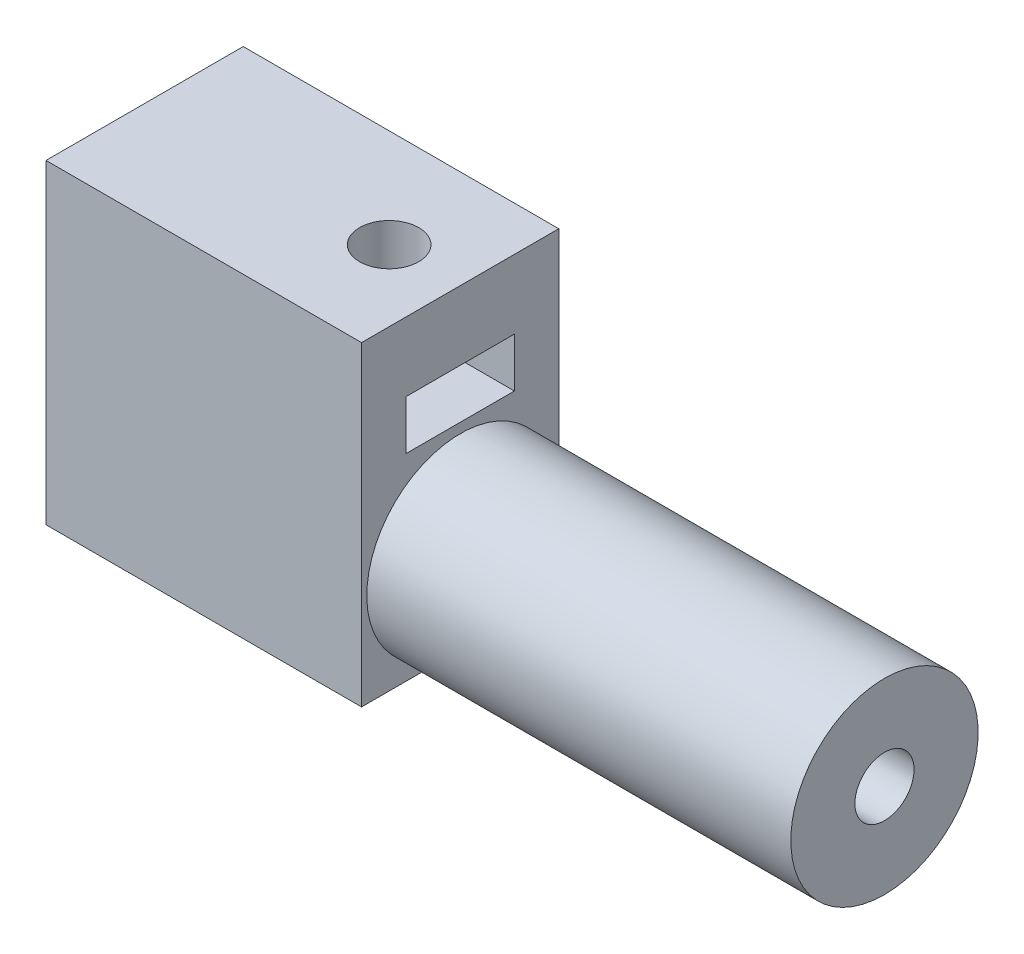
ISO-10303-21;
HEADER;
FILE_DESCRIPTION(('STEP AP214'),'2;1');
FILE_NAME('part.step','',(''),(''),'','','');
FILE_SCHEMA(('AUTOMOTIVE_DESIGN { 1 0 10303 214 1 1 1 1 }'));
ENDSEC;
DATA;
#1=APPLICATION_CONTEXT('core data for automotive mechanical design processes');
#2=APPLICATION_PROTOCOL_DEFINITION('international standard','automotive_design',2000,#1);
#3=PRODUCT_CONTEXT('',#1,'mechanical');
#4=PRODUCT('Part','Part','',(#3));
#5=PRODUCT_RELATED_PRODUCT_CATEGORY('part','',(#4));
#6=PRODUCT_DEFINITION_FORMATION('','',#4);
#7=PRODUCT_DEFINITION_CONTEXT('part definition',#1,'design');
#8=PRODUCT_DEFINITION('design','',#6,#7);
#9=PRODUCT_DEFINITION_SHAPE('','',#8);
#10=(LENGTH_UNIT() NAMED_UNIT(*) SI_UNIT(.MILLI.,.METRE.));
#11=(NAMED_UNIT(*) PLANE_ANGLE_UNIT() SI_UNIT($,.RADIAN.));
#12=(NAMED_UNIT(*) SI_UNIT($,.STERADIAN.) SOLID_ANGLE_UNIT());
#13=UNCERTAINTY_MEASURE_WITH_UNIT(LENGTH_MEASURE(1.E-05),#10,'distance_accuracy_value','');
#14=(GEOMETRIC_REPRESENTATION_CONTEXT(3) GLOBAL_UNCERTAINTY_ASSIGNED_CONTEXT((#13)) GLOBAL_UNIT_ASSIGNED_CONTEXT((#10,
#11,#12)) REPRESENTATION_CONTEXT('',''));
#15=CARTESIAN_POINT('',(0.,0.,0.));
#16=DIRECTION('',(0.,0.,1.));
#17=DIRECTION('',(1.,0.,0.));
#18=AXIS2_PLACEMENT_3D('',#15,#16,#17);
#19=CARTESIAN_POINT('',(29.5,-3.25,4.98546469848549));
#20=DIRECTION('',(-1.,0.,0.));
#21=DIRECTION('',(0.,-1.,0.));
#22=AXIS2_PLACEMENT_3D('',#19,#20,#21);
#23=CYLINDRICAL_SURFACE('',#22,4.75);
#24=CARTESIAN_POINT('',(8.,-3.25,4.98546469848549));
#25=DIRECTION('',(1.,0.,0.));
#26=DIRECTION('',(0.,1.,0.));
#27=AXIS2_PLACEMENT_3D('',#24,#25,#26);
#28=CIRCLE('',#27,4.75);
#29=CARTESIAN_POINT('',(8.,-8.,4.98546469848549));
#30=VERTEX_POINT('',#29);
#31=EDGE_CURVE('E263',#30,#30,#28,.T.);
#32=ORIENTED_EDGE('',*,*,#31,.T.);
#33=EDGE_LOOP('',(#32));
#34=FACE_BOUND('',#33,.T.);
#35=CARTESIAN_POINT('',(29.5,-3.25,4.98546469848549));
#36=DIRECTION('',(1.,0.,0.));
#37=DIRECTION('',(0.,1.,0.));
#38=AXIS2_PLACEMENT_3D('',#35,#36,#37);
#39=CIRCLE('',#38,4.75);
#40=CARTESIAN_POINT('',(29.5,1.5,4.98546469848549));
#41=VERTEX_POINT('',#40);
#42=EDGE_CURVE('E264',#41,#41,#39,.T.);
#43=ORIENTED_EDGE('',*,*,#42,.F.);
#44=EDGE_LOOP('',(#43));
#45=FACE_BOUND('',#44,.T.);
#46=CARTESIAN_POINT('',(23.5,-3.25,4.98546469848549));
#47=DIRECTION('',(1.,0.,0.));
#48=DIRECTION('',(0.,0.,-1.));
#49=AXIS2_PLACEMENT_3D('',#46,#47,#48);
#50=CIRCLE('',#49,4.75);
#51=CARTESIAN_POINT('',(23.5,-7.12096352717507,7.73830711520322));
#52=VERTEX_POINT('',#51);
#53=CARTESIAN_POINT('',(23.5,-7.12500002743416,2.23830711520322));
#54=VERTEX_POINT('',#53);
#55=EDGE_CURVE('E207',#52,#54,#50,.T.);
#56=ORIENTED_EDGE('',*,*,#55,.F.);
#57=DIRECTION('',(-1.,0.,0.));
#58=VECTOR('',#57,1.);
#59=CARTESIAN_POINT('',(29.5,-7.12096352717507,7.73830711520322));
#60=LINE('',#59,#58);
#61=CARTESIAN_POINT('',(26.,-7.12096352717507,7.73830711520322));
#62=VERTEX_POINT('',#61);
#63=EDGE_CURVE('E43',#62,#52,#60,.T.);
#64=ORIENTED_EDGE('',*,*,#63,.F.);
#65=CARTESIAN_POINT('',(26.,-3.25,4.98546469848549));
#66=DIRECTION('',(1.,0.,0.));
#67=DIRECTION('',(0.,0.,-1.));
#68=AXIS2_PLACEMENT_3D('',#65,#66,#67);
#69=CIRCLE('',#68,4.75);
#70=CARTESIAN_POINT('',(26.,-7.12500002743416,2.23830711520322));
#71=VERTEX_POINT('',#70);
#72=EDGE_CURVE('E251',#62,#71,#69,.T.);
#73=ORIENTED_EDGE('',*,*,#72,.T.);
#74=DIRECTION('',(-1.,0.,0.));
#75=VECTOR('',#74,1.);
#76=CARTESIAN_POINT('',(29.5,-7.12500002743416,2.23830711520322));
#77=LINE('',#76,#75);
#78=EDGE_CURVE('E11',#71,#54,#77,.T.);
#79=ORIENTED_EDGE('',*,*,#78,.T.);
#80=EDGE_LOOP('',(#56,#64,#73,#79));
#81=FACE_BOUND('',#80,.T.);
#82=ADVANCED_FACE('F35',(#34,#45,#81),#23,.T.);
#83=CARTESIAN_POINT('',(8.,8.,10.));
#84=DIRECTION('',(-1.,0.,0.));
#85=DIRECTION('',(0.,-1.,0.));
#86=AXIS2_PLACEMENT_3D('',#83,#84,#85);
#87=PLANE('',#86);
#88=DIRECTION('',(0.,0.,-1.));
#89=VECTOR('',#88,1.);
#90=CARTESIAN_POINT('',(8.,-8.,10.));
#91=LINE('',#90,#89);
#92=CARTESIAN_POINT('',(8.,-8.,10.));
#93=VERTEX_POINT('',#92);
#94=EDGE_CURVE('E394',#93,#30,#91,.T.);
#95=ORIENTED_EDGE('',*,*,#94,.T.);
#96=ORIENTED_EDGE('',*,*,#31,.F.);
#97=CARTESIAN_POINT('',(8.,-8.,0.));
#98=VERTEX_POINT('',#97);
#99=EDGE_CURVE('E385',#30,#98,#91,.T.);
#100=ORIENTED_EDGE('',*,*,#99,.T.);
#101=DIRECTION('',(0.,1.,0.));
#102=VECTOR('',#101,1.);
#103=CARTESIAN_POINT('',(8.,8.,0.));
#104=LINE('',#103,#102);
#105=CARTESIAN_POINT('',(8.,8.,0.));
#106=VERTEX_POINT('',#105);
#107=EDGE_CURVE('E374',#98,#106,#104,.T.);
#108=ORIENTED_EDGE('',*,*,#107,.T.);
#109=DIRECTION('',(0.,0.,-1.));
#110=VECTOR('',#109,1.);
#111=CARTESIAN_POINT('',(8.,8.,10.));
#112=LINE('',#111,#110);
#113=CARTESIAN_POINT('',(8.,8.,10.));
#114=VERTEX_POINT('',#113);
#115=EDGE_CURVE('E402',#114,#106,#112,.T.);
#116=ORIENTED_EDGE('',*,*,#115,.F.);
#117=DIRECTION('',(0.,1.,0.));
#118=VECTOR('',#117,1.);
#119=CARTESIAN_POINT('',(8.,8.,10.));
#120=LINE('',#119,#118);
#121=EDGE_CURVE('E375',#93,#114,#120,.T.);
#122=ORIENTED_EDGE('',*,*,#121,.F.);
#123=EDGE_LOOP('',(#95,#96,#100,#108,#116,#122));
#124=FACE_BOUND('',#123,.T.);
#125=DIRECTION('',(0.,0.,-1.));
#126=VECTOR('',#125,1.);
#127=CARTESIAN_POINT('',(8.,2.,10.));
#128=LINE('',#127,#126);
#129=CARTESIAN_POINT('',(8.,2.,7.7493339498322));
#130=VERTEX_POINT('',#129);
#131=CARTESIAN_POINT('',(8.,2.,2.2506660501678));
#132=VERTEX_POINT('',#131);
#133=EDGE_CURVE('E326',#130,#132,#128,.T.);
#134=ORIENTED_EDGE('',*,*,#133,.F.);
#135=DIRECTION('',(0.,-1.,0.));
#136=VECTOR('',#135,1.);
#137=CARTESIAN_POINT('',(8.,8.,7.7493339498322));
#138=LINE('',#137,#136);
#139=CARTESIAN_POINT('',(8.,4.5,7.7493339498322));
#140=VERTEX_POINT('',#139);
#141=EDGE_CURVE('E405',#140,#130,#138,.T.);
#142=ORIENTED_EDGE('',*,*,#141,.F.);
#143=DIRECTION('',(0.,0.,-1.));
#144=VECTOR('',#143,1.);
#145=CARTESIAN_POINT('',(8.,4.5,10.));
#146=LINE('',#145,#144);
#147=CARTESIAN_POINT('',(8.,4.5,2.2506660501678));
#148=VERTEX_POINT('',#147);
#149=EDGE_CURVE('E313',#140,#148,#146,.T.);
#150=ORIENTED_EDGE('',*,*,#149,.T.);
#151=DIRECTION('',(0.,-1.,0.));
#152=VECTOR('',#151,1.);
#153=CARTESIAN_POINT('',(8.,8.,2.2506660501678));
#154=LINE('',#153,#152);
#155=EDGE_CURVE('E409',#148,#132,#154,.T.);
#156=ORIENTED_EDGE('',*,*,#155,.T.);
#157=EDGE_LOOP('',(#134,#142,#150,#156));
#158=FACE_BOUND('',#157,.T.);
#159=ADVANCED_FACE('F37',(#124,#158),#87,.F.);
#160=CARTESIAN_POINT('',(-8.,8.,10.));
#161=DIRECTION('',(0.,-1.,0.));
#162=DIRECTION('',(0.,0.,-1.));
#163=AXIS2_PLACEMENT_3D('',#160,#161,#162);
#164=PLANE('',#163);
#165=CARTESIAN_POINT('',(4.4,8.,5.));
#166=DIRECTION('',(0.,1.,0.));
#167=DIRECTION('',(0.,0.,1.));
#168=AXIS2_PLACEMENT_3D('',#165,#166,#167);
#169=CIRCLE('',#168,1.5);
#170=CARTESIAN_POINT('',(4.4,8.,6.5));
#171=VERTEX_POINT('',#170);
#172=EDGE_CURVE('E368',#171,#171,#169,.T.);
#173=ORIENTED_EDGE('',*,*,#172,.F.);
#174=EDGE_LOOP('',(#173));
#175=FACE_BOUND('',#174,.T.);
#176=DIRECTION('',(-1.,0.,0.));
#177=VECTOR('',#176,1.);
#178=CARTESIAN_POINT('',(-8.,8.,0.));
#179=LINE('',#178,#177);
#180=CARTESIAN_POINT('',(-8.,8.,0.));
#181=VERTEX_POINT('',#180);
#182=EDGE_CURVE('E388',#106,#181,#179,.T.);
#183=ORIENTED_EDGE('',*,*,#182,.T.);
#184=DIRECTION('',(0.,0.,-1.));
#185=VECTOR('',#184,1.);
#186=CARTESIAN_POINT('',(-8.,8.,10.));
#187=LINE('',#186,#185);
#188=CARTESIAN_POINT('',(-8.,8.,10.));
#189=VERTEX_POINT('',#188);
#190=EDGE_CURVE('E399',#189,#181,#187,.T.);
#191=ORIENTED_EDGE('',*,*,#190,.F.);
#192=DIRECTION('',(-1.,0.,0.));
#193=VECTOR('',#192,1.);
#194=CARTESIAN_POINT('',(-8.,8.,10.));
#195=LINE('',#194,#193);
#196=EDGE_CURVE('E378',#114,#189,#195,.T.);
#197=ORIENTED_EDGE('',*,*,#196,.F.);
#198=ORIENTED_EDGE('',*,*,#115,.T.);
#199=EDGE_LOOP('',(#183,#191,#197,#198));
#200=FACE_BOUND('',#199,.T.);
#201=ADVANCED_FACE('F443',(#175,#200),#164,.F.);
#202=CARTESIAN_POINT('',(-8.,8.,10.));
#203=DIRECTION('',(1.,0.,0.));
#204=DIRECTION('',(0.,1.,0.));
#205=AXIS2_PLACEMENT_3D('',#202,#203,#204);
#206=PLANE('',#205);
#207=CARTESIAN_POINT('',(-8.,-3.97,5.));
#208=DIRECTION('',(-1.,0.,0.));
#209=DIRECTION('',(0.,-1.,0.));
#210=AXIS2_PLACEMENT_3D('',#207,#208,#209);
#211=CIRCLE('',#210,1.5);
#212=CARTESIAN_POINT('',(-8.,-5.47,5.));
#213=VERTEX_POINT('',#212);
#214=EDGE_CURVE('E371',#213,#213,#211,.T.);
#215=ORIENTED_EDGE('',*,*,#214,.F.);
#216=EDGE_LOOP('',(#215));
#217=FACE_BOUND('',#216,.T.);
#218=DIRECTION('',(0.,-1.,0.));
#219=VECTOR('',#218,1.);
#220=CARTESIAN_POINT('',(-8.,8.,0.));
#221=LINE('',#220,#219);
#222=CARTESIAN_POINT('',(-8.,-8.,0.));
#223=VERTEX_POINT('',#222);
#224=EDGE_CURVE('E390',#181,#223,#221,.T.);
#225=ORIENTED_EDGE('',*,*,#224,.T.);
#226=DIRECTION('',(0.,0.,-1.));
#227=VECTOR('',#226,1.);
#228=CARTESIAN_POINT('',(-8.,-8.,10.));
#229=LINE('',#228,#227);
#230=CARTESIAN_POINT('',(-8.,-8.,10.));
#231=VERTEX_POINT('',#230);
#232=EDGE_CURVE('E396',#231,#223,#229,.T.);
#233=ORIENTED_EDGE('',*,*,#232,.F.);
#234=DIRECTION('',(0.,-1.,0.));
#235=VECTOR('',#234,1.);
#236=CARTESIAN_POINT('',(-8.,8.,10.));
#237=LINE('',#236,#235);
#238=EDGE_CURVE('E381',#189,#231,#237,.T.);
#239=ORIENTED_EDGE('',*,*,#238,.F.);
#240=ORIENTED_EDGE('',*,*,#190,.T.);
#241=EDGE_LOOP('',(#225,#233,#239,#240));
#242=FACE_BOUND('',#241,.T.);
#243=ADVANCED_FACE('F529',(#217,#242),#206,.F.);
#244=CARTESIAN_POINT('',(-8.,-8.,10.));
#245=DIRECTION('',(0.,1.,0.));
#246=DIRECTION('',(0.,0.,1.));
#247=AXIS2_PLACEMENT_3D('',#244,#245,#246);
#248=PLANE('',#247);
#249=DIRECTION('',(1.,0.,0.));
#250=VECTOR('',#249,1.);
#251=CARTESIAN_POINT('',(-8.,-8.,7.75));
#252=LINE('',#251,#250);
#253=CARTESIAN_POINT('',(-4.5,-8.,7.75));
#254=VERTEX_POINT('',#253);
#255=CARTESIAN_POINT('',(-2.,-8.,7.75));
#256=VERTEX_POINT('',#255);
#257=EDGE_CURVE('E331',#254,#256,#252,.T.);
#258=ORIENTED_EDGE('',*,*,#257,.T.);
#259=DIRECTION('',(0.,0.,-1.));
#260=VECTOR('',#259,1.);
#261=CARTESIAN_POINT('',(-2.,-8.,10.));
#262=LINE('',#261,#260);
#263=CARTESIAN_POINT('',(-2.,-8.,2.25));
#264=VERTEX_POINT('',#263);
#265=EDGE_CURVE('E337',#256,#264,#262,.T.);
#266=ORIENTED_EDGE('',*,*,#265,.T.);
#267=DIRECTION('',(-1.,0.,0.));
#268=VECTOR('',#267,1.);
#269=CARTESIAN_POINT('',(-8.,-8.,2.25));
#270=LINE('',#269,#268);
#271=CARTESIAN_POINT('',(-4.5,-8.,2.25));
#272=VERTEX_POINT('',#271);
#273=EDGE_CURVE('E328',#264,#272,#270,.T.);
#274=ORIENTED_EDGE('',*,*,#273,.T.);
#275=DIRECTION('',(0.,0.,-1.));
#276=VECTOR('',#275,1.);
#277=CARTESIAN_POINT('',(-4.5,-8.,10.));
#278=LINE('',#277,#276);
#279=EDGE_CURVE('E334',#254,#272,#278,.T.);
#280=ORIENTED_EDGE('',*,*,#279,.F.);
#281=EDGE_LOOP('',(#258,#266,#274,#280));
#282=FACE_BOUND('',#281,.T.);
#283=DIRECTION('',(1.,0.,0.));
#284=VECTOR('',#283,1.);
#285=CARTESIAN_POINT('',(-8.,-8.,0.));
#286=LINE('',#285,#284);
#287=EDGE_CURVE('E379',#223,#98,#286,.T.);
#288=ORIENTED_EDGE('',*,*,#287,.T.);
#289=ORIENTED_EDGE('',*,*,#99,.F.);
#290=ORIENTED_EDGE('',*,*,#94,.F.);
#291=DIRECTION('',(1.,0.,0.));
#292=VECTOR('',#291,1.);
#293=CARTESIAN_POINT('',(-8.,-8.,10.));
#294=LINE('',#293,#292);
#295=EDGE_CURVE('E383',#231,#93,#294,.T.);
#296=ORIENTED_EDGE('',*,*,#295,.F.);
#297=ORIENTED_EDGE('',*,*,#232,.T.);
#298=EDGE_LOOP('',(#288,#289,#290,#296,#297));
#299=FACE_BOUND('',#298,.T.);
#300=ADVANCED_FACE('F522',(#282,#299),#248,.F.);
#301=CARTESIAN_POINT('',(0.,0.,10.));
#302=DIRECTION('',(0.,0.,1.));
#303=DIRECTION('',(1.,0.,0.));
#304=AXIS2_PLACEMENT_3D('',#301,#302,#303);
#305=PLANE('',#304);
#306=ORIENTED_EDGE('',*,*,#121,.T.);
#307=ORIENTED_EDGE('',*,*,#196,.T.);
#308=ORIENTED_EDGE('',*,*,#238,.T.);
#309=ORIENTED_EDGE('',*,*,#295,.T.);
#310=EDGE_LOOP('',(#306,#307,#308,#309));
#311=FACE_BOUND('',#310,.T.);
#312=ADVANCED_FACE('F519',(#311),#305,.T.);
#313=CARTESIAN_POINT('',(0.,0.,0.));
#314=DIRECTION('',(0.,0.,1.));
#315=DIRECTION('',(1.,0.,0.));
#316=AXIS2_PLACEMENT_3D('',#313,#314,#315);
#317=PLANE('',#316);
#318=ORIENTED_EDGE('',*,*,#107,.F.);
#319=ORIENTED_EDGE('',*,*,#287,.F.);
#320=ORIENTED_EDGE('',*,*,#224,.F.);
#321=ORIENTED_EDGE('',*,*,#182,.F.);
#322=EDGE_LOOP('',(#318,#319,#320,#321));
#323=FACE_BOUND('',#322,.T.);
#324=ADVANCED_FACE('F517',(#323),#317,.F.);
#325=CARTESIAN_POINT('',(-2.,-3.97,5.));
#326=DIRECTION('',(-1.,0.,0.));
#327=DIRECTION('',(0.,-1.,0.));
#328=AXIS2_PLACEMENT_3D('',#325,#326,#327);
#329=CYLINDRICAL_SURFACE('',#328,1.5);
#330=CARTESIAN_POINT('',(-4.5,-3.97,5.));
#331=DIRECTION('',(-1.,0.,0.));
#332=DIRECTION('',(0.,0.,1.));
#333=AXIS2_PLACEMENT_3D('',#330,#331,#332);
#334=CIRCLE('',#333,1.5);
#335=CARTESIAN_POINT('',(-4.5,-3.97,6.5));
#336=VERTEX_POINT('',#335);
#337=EDGE_CURVE('E363',#336,#336,#334,.F.);
#338=ORIENTED_EDGE('',*,*,#337,.T.);
#339=EDGE_LOOP('',(#338));
#340=FACE_BOUND('',#339,.T.);
#341=ORIENTED_EDGE('',*,*,#214,.T.);
#342=EDGE_LOOP('',(#341));
#343=FACE_BOUND('',#342,.T.);
#344=ADVANCED_FACE('F510',(#340,#343),#329,.F.);
#345=CARTESIAN_POINT('',(4.4,2.,5.));
#346=DIRECTION('',(0.,1.,0.));
#347=DIRECTION('',(0.,0.,1.));
#348=AXIS2_PLACEMENT_3D('',#345,#346,#347);
#349=CYLINDRICAL_SURFACE('',#348,1.5);
#350=CARTESIAN_POINT('',(4.4,4.5,5.));
#351=DIRECTION('',(0.,1.,0.));
#352=DIRECTION('',(0.,0.,1.));
#353=AXIS2_PLACEMENT_3D('',#350,#351,#352);
#354=CIRCLE('',#353,1.5);
#355=CARTESIAN_POINT('',(4.4,4.5,6.5));
#356=VERTEX_POINT('',#355);
#357=EDGE_CURVE('E267',#356,#356,#354,.F.);
#358=ORIENTED_EDGE('',*,*,#357,.T.);
#359=EDGE_LOOP('',(#358));
#360=FACE_BOUND('',#359,.T.);
#361=ORIENTED_EDGE('',*,*,#172,.T.);
#362=EDGE_LOOP('',(#361));
#363=FACE_BOUND('',#362,.T.);
#364=ADVANCED_FACE('F488',(#360,#363),#349,.F.);
#365=CARTESIAN_POINT('',(-4.5,0.,0.));
#366=DIRECTION('',(-1.,0.,0.));
#367=DIRECTION('',(0.,0.,1.));
#368=AXIS2_PLACEMENT_3D('',#365,#366,#367);
#369=PLANE('',#368);
#370=ORIENTED_EDGE('',*,*,#337,.F.);
#371=EDGE_LOOP('',(#370));
#372=FACE_BOUND('',#371,.T.);
#373=DIRECTION('',(0.,0.500000000000006,-0.866025403784435));
#374=VECTOR('',#373,1.);
#375=CARTESIAN_POINT('',(-4.5,-2.38228675972855,7.75000000000001));
#376=LINE('',#375,#374);
#377=CARTESIAN_POINT('',(-4.5,-2.38228675972855,7.75000000000001));
#378=VERTEX_POINT('',#377);
#379=CARTESIAN_POINT('',(-4.5,-0.794573519457058,5.00000000000002));
#380=VERTEX_POINT('',#379);
#381=EDGE_CURVE('E354',#378,#380,#376,.T.);
#382=ORIENTED_EDGE('',*,*,#381,.F.);
#383=DIRECTION('',(0.,1.,0.));
#384=VECTOR('',#383,1.);
#385=CARTESIAN_POINT('',(-4.5,-5.55771324027149,7.74999999999999));
#386=LINE('',#385,#384);
#387=EDGE_CURVE('E340',#254,#378,#386,.T.);
#388=ORIENTED_EDGE('',*,*,#387,.F.);
#389=ORIENTED_EDGE('',*,*,#279,.T.);
#390=DIRECTION('',(0.,-1.,0.));
#391=VECTOR('',#390,1.);
#392=CARTESIAN_POINT('',(-4.5,-2.38228675972851,2.25));
#393=LINE('',#392,#391);
#394=CARTESIAN_POINT('',(-4.5,-2.38228675972851,2.25));
#395=VERTEX_POINT('',#394);
#396=EDGE_CURVE('E344',#395,#272,#393,.T.);
#397=ORIENTED_EDGE('',*,*,#396,.F.);
#398=DIRECTION('',(0.,-0.499999999999994,-0.866025403784442));
#399=VECTOR('',#398,1.);
#400=CARTESIAN_POINT('',(-4.5,-0.794573519457058,5.00000000000002));
#401=LINE('',#400,#399);
#402=EDGE_CURVE('E357',#380,#395,#401,.T.);
#403=ORIENTED_EDGE('',*,*,#402,.F.);
#404=EDGE_LOOP('',(#382,#388,#389,#397,#403));
#405=FACE_BOUND('',#404,.T.);
#406=ADVANCED_FACE('F484',(#372,#405),#369,.F.);
#407=CARTESIAN_POINT('',(-2.,-5.55771324027149,7.74999999999999));
#408=DIRECTION('',(0.,0.,1.));
#409=DIRECTION('',(0.,-1.,0.));
#410=AXIS2_PLACEMENT_3D('',#407,#408,#409);
#411=PLANE('',#410);
#412=DIRECTION('',(-1.,0.,0.));
#413=VECTOR('',#412,1.);
#414=CARTESIAN_POINT('',(-2.,-2.38228675972855,7.75000000000001));
#415=LINE('',#414,#413);
#416=CARTESIAN_POINT('',(-2.,-2.38228675972855,7.75000000000001));
#417=VERTEX_POINT('',#416);
#418=EDGE_CURVE('E352',#417,#378,#415,.T.);
#419=ORIENTED_EDGE('',*,*,#418,.F.);
#420=DIRECTION('',(0.,1.,0.));
#421=VECTOR('',#420,1.);
#422=CARTESIAN_POINT('',(-2.,-5.55771324027149,7.74999999999999));
#423=LINE('',#422,#421);
#424=EDGE_CURVE('E341',#256,#417,#423,.T.);
#425=ORIENTED_EDGE('',*,*,#424,.F.);
#426=ORIENTED_EDGE('',*,*,#257,.F.);
#427=ORIENTED_EDGE('',*,*,#387,.T.);
#428=EDGE_LOOP('',(#419,#425,#426,#427));
#429=FACE_BOUND('',#428,.T.);
#430=ADVANCED_FACE('F487',(#429),#411,.F.);
#431=CARTESIAN_POINT('',(-2.,-2.38228675972851,2.25));
#432=DIRECTION('',(0.,0.,-1.));
#433=DIRECTION('',(0.,1.,0.));
#434=AXIS2_PLACEMENT_3D('',#431,#432,#433);
#435=PLANE('',#434);
#436=ORIENTED_EDGE('',*,*,#396,.T.);
#437=ORIENTED_EDGE('',*,*,#273,.F.);
#438=DIRECTION('',(0.,-1.,0.));
#439=VECTOR('',#438,1.);
#440=CARTESIAN_POINT('',(-2.,-2.38228675972851,2.25));
#441=LINE('',#440,#439);
#442=CARTESIAN_POINT('',(-2.,-2.38228675972851,2.25));
#443=VERTEX_POINT('',#442);
#444=EDGE_CURVE('E350',#443,#264,#441,.T.);
#445=ORIENTED_EDGE('',*,*,#444,.F.);
#446=DIRECTION('',(-1.,0.,0.));
#447=VECTOR('',#446,1.);
#448=CARTESIAN_POINT('',(-2.,-2.38228675972851,2.25));
#449=LINE('',#448,#447);
#450=EDGE_CURVE('E361',#443,#395,#449,.T.);
#451=ORIENTED_EDGE('',*,*,#450,.T.);
#452=EDGE_LOOP('',(#436,#437,#445,#451));
#453=FACE_BOUND('',#452,.T.);
#454=ADVANCED_FACE('F490',(#453),#435,.F.);
#455=CARTESIAN_POINT('',(-2.,-0.794573519457058,5.00000000000002));
#456=DIRECTION('',(0.,0.866025403784442,-0.499999999999994));
#457=DIRECTION('',(0.,0.499999999999994,0.866025403784442));
#458=AXIS2_PLACEMENT_3D('',#455,#456,#457);
#459=PLANE('',#458);
#460=ORIENTED_EDGE('',*,*,#402,.T.);
#461=ORIENTED_EDGE('',*,*,#450,.F.);
#462=DIRECTION('',(0.,-0.499999999999994,-0.866025403784442));
#463=VECTOR('',#462,1.);
#464=CARTESIAN_POINT('',(-2.,-0.794573519457058,5.00000000000002));
#465=LINE('',#464,#463);
#466=CARTESIAN_POINT('',(-2.,-0.794573519457058,5.00000000000002));
#467=VERTEX_POINT('',#466);
#468=EDGE_CURVE('E347',#467,#443,#465,.T.);
#469=ORIENTED_EDGE('',*,*,#468,.F.);
#470=DIRECTION('',(-1.,0.,0.));
#471=VECTOR('',#470,1.);
#472=CARTESIAN_POINT('',(-2.,-0.794573519457058,5.00000000000002));
#473=LINE('',#472,#471);
#474=EDGE_CURVE('E364',#467,#380,#473,.T.);
#475=ORIENTED_EDGE('',*,*,#474,.T.);
#476=EDGE_LOOP('',(#460,#461,#469,#475));
#477=FACE_BOUND('',#476,.T.);
#478=ADVANCED_FACE('F493',(#477),#459,.F.);
#479=CARTESIAN_POINT('',(-2.,-2.38228675972855,7.75000000000001));
#480=DIRECTION('',(0.,0.866025403784435,0.500000000000006));
#481=DIRECTION('',(0.,-0.500000000000006,0.866025403784435));
#482=AXIS2_PLACEMENT_3D('',#479,#480,#481);
#483=PLANE('',#482);
#484=ORIENTED_EDGE('',*,*,#381,.T.);
#485=ORIENTED_EDGE('',*,*,#474,.F.);
#486=DIRECTION('',(0.,0.500000000000006,-0.866025403784435));
#487=VECTOR('',#486,1.);
#488=CARTESIAN_POINT('',(-2.,-2.38228675972855,7.75000000000001));
#489=LINE('',#488,#487);
#490=EDGE_CURVE('E343',#417,#467,#489,.T.);
#491=ORIENTED_EDGE('',*,*,#490,.F.);
#492=ORIENTED_EDGE('',*,*,#418,.T.);
#493=EDGE_LOOP('',(#484,#485,#491,#492));
#494=FACE_BOUND('',#493,.T.);
#495=ADVANCED_FACE('F497',(#494),#483,.F.);
#496=CARTESIAN_POINT('',(-2.,-3.97,5.));
#497=DIRECTION('',(-1.,0.,0.));
#498=DIRECTION('',(0.,-1.,0.));
#499=AXIS2_PLACEMENT_3D('',#496,#497,#498);
#500=PLANE('',#499);
#501=ORIENTED_EDGE('',*,*,#265,.F.);
#502=ORIENTED_EDGE('',*,*,#424,.T.);
#503=ORIENTED_EDGE('',*,*,#490,.T.);
#504=ORIENTED_EDGE('',*,*,#468,.T.);
#505=ORIENTED_EDGE('',*,*,#444,.T.);
#506=EDGE_LOOP('',(#501,#502,#503,#504,#505));
#507=FACE_BOUND('',#506,.T.);
#508=ADVANCED_FACE('F482',(#507),#500,.T.);
#509=CARTESIAN_POINT('',(0.,2.,2.2506660501678));
#510=DIRECTION('',(0.,0.,-1.));
#511=DIRECTION('',(-1.,0.,0.));
#512=AXIS2_PLACEMENT_3D('',#509,#510,#511);
#513=PLANE('',#512);
#514=DIRECTION('',(-1.,0.,0.));
#515=VECTOR('',#514,1.);
#516=CARTESIAN_POINT('',(0.,4.5,2.2506660501678));
#517=LINE('',#516,#515);
#518=CARTESIAN_POINT('',(4.46052133756023,4.5,2.2506660501678));
#519=VERTEX_POINT('',#518);
#520=EDGE_CURVE('E58',#148,#519,#517,.T.);
#521=ORIENTED_EDGE('',*,*,#520,.T.);
#522=DIRECTION('',(0.,1.,0.));
#523=VECTOR('',#522,1.);
#524=CARTESIAN_POINT('',(4.46052133756023,2.,2.2506660501678));
#525=LINE('',#524,#523);
#526=CARTESIAN_POINT('',(4.46052133756023,2.,2.2506660501678));
#527=VERTEX_POINT('',#526);
#528=EDGE_CURVE('E290',#527,#519,#525,.T.);
#529=ORIENTED_EDGE('',*,*,#528,.F.);
#530=DIRECTION('',(-1.,0.,0.));
#531=VECTOR('',#530,1.);
#532=CARTESIAN_POINT('',(0.,2.,2.2506660501678));
#533=LINE('',#532,#531);
#534=EDGE_CURVE('E270',#132,#527,#533,.T.);
#535=ORIENTED_EDGE('',*,*,#534,.F.);
#536=ORIENTED_EDGE('',*,*,#155,.F.);
#537=EDGE_LOOP('',(#521,#529,#535,#536));
#538=FACE_BOUND('',#537,.T.);
#539=ADVANCED_FACE('F458',(#538),#513,.F.);
#540=CARTESIAN_POINT('',(0.,2.,7.7493339498322));
#541=DIRECTION('',(0.,0.,-1.));
#542=DIRECTION('',(-1.,0.,0.));
#543=AXIS2_PLACEMENT_3D('',#540,#541,#542);
#544=PLANE('',#543);
#545=ORIENTED_EDGE('',*,*,#141,.T.);
#546=DIRECTION('',(-1.,0.,0.));
#547=VECTOR('',#546,1.);
#548=CARTESIAN_POINT('',(0.,2.,7.7493339498322));
#549=LINE('',#548,#547);
#550=CARTESIAN_POINT('',(5.94801991528197,2.,7.7493339498322));
#551=VERTEX_POINT('',#550);
#552=EDGE_CURVE('E288',#130,#551,#549,.T.);
#553=ORIENTED_EDGE('',*,*,#552,.T.);
#554=DIRECTION('',(0.,1.,0.));
#555=VECTOR('',#554,1.);
#556=CARTESIAN_POINT('',(5.94801991528197,2.,7.7493339498322));
#557=LINE('',#556,#555);
#558=CARTESIAN_POINT('',(5.94801991528197,4.5,7.7493339498322));
#559=VERTEX_POINT('',#558);
#560=EDGE_CURVE('E310',#551,#559,#557,.T.);
#561=ORIENTED_EDGE('',*,*,#560,.T.);
#562=DIRECTION('',(-1.,0.,0.));
#563=VECTOR('',#562,1.);
#564=CARTESIAN_POINT('',(0.,4.5,7.7493339498322));
#565=LINE('',#564,#563);
#566=EDGE_CURVE('E273',#140,#559,#565,.T.);
#567=ORIENTED_EDGE('',*,*,#566,.F.);
#568=EDGE_LOOP('',(#545,#553,#561,#567));
#569=FACE_BOUND('',#568,.T.);
#570=ADVANCED_FACE('F454',(#569),#544,.T.);
#571=CARTESIAN_POINT('',(0.,4.5,0.));
#572=DIRECTION('',(0.,1.,0.));
#573=DIRECTION('',(0.,0.,1.));
#574=AXIS2_PLACEMENT_3D('',#571,#572,#573);
#575=PLANE('',#574);
#576=ORIENTED_EDGE('',*,*,#357,.F.);
#577=EDGE_LOOP('',(#576));
#578=FACE_BOUND('',#577,.T.);
#579=ORIENTED_EDGE('',*,*,#566,.T.);
#580=DIRECTION('',(0.518938178441556,0.,-0.854811772822392));
#581=VECTOR('',#580,1.);
#582=CARTESIAN_POINT('',(7.78379863136116,4.5,4.72537979885041));
#583=LINE('',#582,#581);
#584=CARTESIAN_POINT('',(5.92680735846755,4.5,7.78427596036432));
#585=VERTEX_POINT('',#584);
#586=EDGE_CURVE('E306',#585,#559,#583,.T.);
#587=ORIENTED_EDGE('',*,*,#586,.F.);
#588=DIRECTION('',(0.999757799938981,0.,0.0220077591128146));
#589=VECTOR('',#588,1.);
#590=CARTESIAN_POINT('',(-0.168402379292175,4.5,7.65010155566462));
#591=LINE('',#590,#589);
#592=CARTESIAN_POINT('',(2.75214996641196,4.5,7.71439193930008));
#593=VERTEX_POINT('',#592);
#594=EDGE_CURVE('E303',#593,#585,#591,.T.);
#595=ORIENTED_EDGE('',*,*,#594,.F.);
#596=DIRECTION('',(0.480819621497425,0.,0.876819531935206));
#597=VECTOR('',#596,1.);
#598=CARTESIAN_POINT('',(-1.13643892718947,4.5,0.623186545149362));
#599=LINE('',#598,#597);
#600=CARTESIAN_POINT('',(1.2253426079444,4.5,4.93011597893576));
#601=VERTEX_POINT('',#600);
#602=EDGE_CURVE('E300',#601,#593,#599,.T.);
#603=ORIENTED_EDGE('',*,*,#602,.F.);
#604=DIRECTION('',(-0.518938178441556,0.,0.854811772822391));
#605=VECTOR('',#604,1.);
#606=CARTESIAN_POINT('',(3.08233388083801,4.5,1.87121981742186));
#607=LINE('',#606,#605);
#608=CARTESIAN_POINT('',(2.87319264153244,4.5,2.21572403963568));
#609=VERTEX_POINT('',#608);
#610=EDGE_CURVE('E297',#609,#601,#607,.T.);
#611=ORIENTED_EDGE('',*,*,#610,.F.);
#612=DIRECTION('',(-0.999757799938981,0.,-0.0220077591128146));
#613=VECTOR('',#612,1.);
#614=CARTESIAN_POINT('',(-0.047359704171695,4.5,2.15143365600022));
#615=LINE('',#614,#613);
#616=EDGE_CURVE('E294',#519,#609,#615,.T.);
#617=ORIENTED_EDGE('',*,*,#616,.F.);
#618=ORIENTED_EDGE('',*,*,#520,.F.);
#619=ORIENTED_EDGE('',*,*,#149,.F.);
#620=EDGE_LOOP('',(#579,#587,#595,#603,#611,#617,#618,#619));
#621=FACE_BOUND('',#620,.T.);
#622=ADVANCED_FACE('F450',(#578,#621),#575,.F.);
#623=CARTESIAN_POINT('',(7.78379863136116,2.,4.72537979885041));
#624=DIRECTION('',(0.854811772822392,0.,0.518938178441556));
#625=DIRECTION('',(0.518938178441556,0.,-0.854811772822392));
#626=AXIS2_PLACEMENT_3D('',#623,#624,#625);
#627=PLANE('',#626);
#628=ORIENTED_EDGE('',*,*,#586,.T.);
#629=ORIENTED_EDGE('',*,*,#560,.F.);
#630=DIRECTION('',(0.518938178441556,0.,-0.854811772822392));
#631=VECTOR('',#630,1.);
#632=CARTESIAN_POINT('',(7.78379863136116,2.,4.72537979885041));
#633=LINE('',#632,#631);
#634=CARTESIAN_POINT('',(5.92680735846755,2.,7.78427596036432));
#635=VERTEX_POINT('',#634);
#636=EDGE_CURVE('E285',#635,#551,#633,.T.);
#637=ORIENTED_EDGE('',*,*,#636,.F.);
#638=DIRECTION('',(0.,1.,0.));
#639=VECTOR('',#638,1.);
#640=CARTESIAN_POINT('',(5.92680735846755,2.,7.78427596036432));
#641=LINE('',#640,#639);
#642=EDGE_CURVE('E314',#635,#585,#641,.T.);
#643=ORIENTED_EDGE('',*,*,#642,.T.);
#644=EDGE_LOOP('',(#628,#629,#637,#643));
#645=FACE_BOUND('',#644,.T.);
#646=ADVANCED_FACE('F453',(#645),#627,.F.);
#647=CARTESIAN_POINT('',(-0.168402379292175,2.,7.65010155566462));
#648=DIRECTION('',(-0.0220077591128146,0.,0.999757799938982));
#649=DIRECTION('',(0.999757799938982,0.,0.0220077591128146));
#650=AXIS2_PLACEMENT_3D('',#647,#648,#649);
#651=PLANE('',#650);
#652=ORIENTED_EDGE('',*,*,#594,.T.);
#653=ORIENTED_EDGE('',*,*,#642,.F.);
#654=DIRECTION('',(0.999757799938981,0.,0.0220077591128146));
#655=VECTOR('',#654,1.);
#656=CARTESIAN_POINT('',(-0.168402379292175,2.,7.65010155566462));
#657=LINE('',#656,#655);
#658=CARTESIAN_POINT('',(2.75214996641196,2.,7.71439193930008));
#659=VERTEX_POINT('',#658);
#660=EDGE_CURVE('E282',#659,#635,#657,.T.);
#661=ORIENTED_EDGE('',*,*,#660,.F.);
#662=DIRECTION('',(0.,1.,0.));
#663=VECTOR('',#662,1.);
#664=CARTESIAN_POINT('',(2.75214996641196,2.,7.71439193930008));
#665=LINE('',#664,#663);
#666=EDGE_CURVE('E316',#659,#593,#665,.T.);
#667=ORIENTED_EDGE('',*,*,#666,.T.);
#668=EDGE_LOOP('',(#652,#653,#661,#667));
#669=FACE_BOUND('',#668,.T.);
#670=ADVANCED_FACE('F462',(#669),#651,.F.);
#671=CARTESIAN_POINT('',(-1.13643892718947,2.,0.623186545149362));
#672=DIRECTION('',(-0.876819531935206,0.,0.480819621497425));
#673=DIRECTION('',(0.480819621497425,0.,0.876819531935206));
#674=AXIS2_PLACEMENT_3D('',#671,#672,#673);
#675=PLANE('',#674);
#676=ORIENTED_EDGE('',*,*,#602,.T.);
#677=ORIENTED_EDGE('',*,*,#666,.F.);
#678=DIRECTION('',(0.480819621497425,0.,0.876819531935206));
#679=VECTOR('',#678,1.);
#680=CARTESIAN_POINT('',(-1.13643892718947,2.,0.623186545149362));
#681=LINE('',#680,#679);
#682=CARTESIAN_POINT('',(1.2253426079444,2.,4.93011597893576));
#683=VERTEX_POINT('',#682);
#684=EDGE_CURVE('E279',#683,#659,#681,.T.);
#685=ORIENTED_EDGE('',*,*,#684,.F.);
#686=DIRECTION('',(0.,1.,0.));
#687=VECTOR('',#686,1.);
#688=CARTESIAN_POINT('',(1.2253426079444,2.,4.93011597893576));
#689=LINE('',#688,#687);
#690=EDGE_CURVE('E318',#683,#601,#689,.T.);
#691=ORIENTED_EDGE('',*,*,#690,.T.);
#692=EDGE_LOOP('',(#676,#677,#685,#691));
#693=FACE_BOUND('',#692,.T.);
#694=ADVANCED_FACE('F466',(#693),#675,.F.);
#695=CARTESIAN_POINT('',(3.08233388083801,2.,1.87121981742186));
#696=DIRECTION('',(-0.854811772822391,0.,-0.518938178441556));
#697=DIRECTION('',(-0.518938178441556,0.,0.854811772822391));
#698=AXIS2_PLACEMENT_3D('',#695,#696,#697);
#699=PLANE('',#698);
#700=ORIENTED_EDGE('',*,*,#610,.T.);
#701=ORIENTED_EDGE('',*,*,#690,.F.);
#702=DIRECTION('',(-0.518938178441556,0.,0.854811772822391));
#703=VECTOR('',#702,1.);
#704=CARTESIAN_POINT('',(3.08233388083801,2.,1.87121981742186));
#705=LINE('',#704,#703);
#706=CARTESIAN_POINT('',(2.87319264153244,2.,2.21572403963568));
#707=VERTEX_POINT('',#706);
#708=EDGE_CURVE('E276',#707,#683,#705,.T.);
#709=ORIENTED_EDGE('',*,*,#708,.F.);
#710=DIRECTION('',(0.,1.,0.));
#711=VECTOR('',#710,1.);
#712=CARTESIAN_POINT('',(2.87319264153244,2.,2.21572403963568));
#713=LINE('',#712,#711);
#714=EDGE_CURVE('E320',#707,#609,#713,.T.);
#715=ORIENTED_EDGE('',*,*,#714,.T.);
#716=EDGE_LOOP('',(#700,#701,#709,#715));
#717=FACE_BOUND('',#716,.T.);
#718=ADVANCED_FACE('F470',(#717),#699,.F.);
#719=CARTESIAN_POINT('',(-0.047359704171695,2.,2.15143365600022));
#720=DIRECTION('',(0.0220077591128146,0.,-0.999757799938982));
#721=DIRECTION('',(-0.999757799938982,0.,-0.0220077591128146));
#722=AXIS2_PLACEMENT_3D('',#719,#720,#721);
#723=PLANE('',#722);
#724=ORIENTED_EDGE('',*,*,#616,.T.);
#725=ORIENTED_EDGE('',*,*,#714,.F.);
#726=DIRECTION('',(-0.999757799938981,0.,-0.0220077591128146));
#727=VECTOR('',#726,1.);
#728=CARTESIAN_POINT('',(-0.047359704171695,2.,2.15143365600022));
#729=LINE('',#728,#727);
#730=EDGE_CURVE('E272',#527,#707,#729,.T.);
#731=ORIENTED_EDGE('',*,*,#730,.F.);
#732=ORIENTED_EDGE('',*,*,#528,.T.);
#733=EDGE_LOOP('',(#724,#725,#731,#732));
#734=FACE_BOUND('',#733,.T.);
#735=ADVANCED_FACE('F474',(#734),#723,.F.);
#736=CARTESIAN_POINT('',(4.4,2.,5.));
#737=DIRECTION('',(0.,1.,0.));
#738=DIRECTION('',(0.,0.,1.));
#739=AXIS2_PLACEMENT_3D('',#736,#737,#738);
#740=PLANE('',#739);
#741=ORIENTED_EDGE('',*,*,#133,.T.);
#742=ORIENTED_EDGE('',*,*,#534,.T.);
#743=ORIENTED_EDGE('',*,*,#730,.T.);
#744=ORIENTED_EDGE('',*,*,#708,.T.);
#745=ORIENTED_EDGE('',*,*,#684,.T.);
#746=ORIENTED_EDGE('',*,*,#660,.T.);
#747=ORIENTED_EDGE('',*,*,#636,.T.);
#748=ORIENTED_EDGE('',*,*,#552,.F.);
#749=EDGE_LOOP('',(#741,#742,#743,#744,#745,#746,#747,#748));
#750=FACE_BOUND('',#749,.T.);
#751=ADVANCED_FACE('F478',(#750),#740,.T.);
#752=CARTESIAN_POINT('',(29.5,-3.25,4.98546469848549));
#753=DIRECTION('',(1.,0.,0.));
#754=DIRECTION('',(0.,1.,0.));
#755=AXIS2_PLACEMENT_3D('',#752,#753,#754);
#756=PLANE('',#755);
#757=CARTESIAN_POINT('',(29.5,-3.25,4.98546469848549));
#758=DIRECTION('',(1.,0.,0.));
#759=DIRECTION('',(0.,1.,0.));
#760=AXIS2_PLACEMENT_3D('',#757,#758,#759);
#761=CIRCLE('',#760,1.5);
#762=CARTESIAN_POINT('',(29.5,-1.75,4.98546469848549));
#763=VERTEX_POINT('',#762);
#764=EDGE_CURVE('E260',#763,#763,#761,.T.);
#765=ORIENTED_EDGE('',*,*,#764,.F.);
#766=EDGE_LOOP('',(#765));
#767=FACE_BOUND('',#766,.T.);
#768=ORIENTED_EDGE('',*,*,#42,.T.);
#769=EDGE_LOOP('',(#768));
#770=FACE_BOUND('',#769,.T.);
#771=ADVANCED_FACE('F448',(#767,#770),#756,.T.);
#772=CARTESIAN_POINT('',(23.5,-3.25,4.98546469848549));
#773=DIRECTION('',(1.,0.,0.));
#774=DIRECTION('',(0.,1.,0.));
#775=AXIS2_PLACEMENT_3D('',#772,#773,#774);
#776=CYLINDRICAL_SURFACE('',#775,1.5);
#777=CARTESIAN_POINT('',(26.,-3.25,4.98546469848549));
#778=DIRECTION('',(1.,0.,0.));
#779=DIRECTION('',(0.,0.,-1.));
#780=AXIS2_PLACEMENT_3D('',#777,#778,#779);
#781=CIRCLE('',#780,1.5);
#782=CARTESIAN_POINT('',(26.,-3.25,3.48546469848549));
#783=VERTEX_POINT('',#782);
#784=EDGE_CURVE('E209',#783,#783,#781,.F.);
#785=ORIENTED_EDGE('',*,*,#784,.T.);
#786=EDGE_LOOP('',(#785));
#787=FACE_BOUND('',#786,.T.);
#788=ORIENTED_EDGE('',*,*,#764,.T.);
#789=EDGE_LOOP('',(#788));
#790=FACE_BOUND('',#789,.T.);
#791=ADVANCED_FACE('F663',(#787,#790),#776,.F.);
#792=CARTESIAN_POINT('',(23.5,0.,2.23830711520322));
#793=DIRECTION('',(0.,0.,-1.));
#794=DIRECTION('',(-1.,0.,0.));
#795=AXIS2_PLACEMENT_3D('',#792,#793,#794);
#796=PLANE('',#795);
#797=DIRECTION('',(0.,1.,0.));
#798=VECTOR('',#797,1.);
#799=CARTESIAN_POINT('',(26.,0.,2.23830711520322));
#800=LINE('',#799,#798);
#801=CARTESIAN_POINT('',(26.,-3.12499914954384,2.23830711520322));
#802=VERTEX_POINT('',#801);
#803=EDGE_CURVE('E50',#71,#802,#800,.T.);
#804=ORIENTED_EDGE('',*,*,#803,.T.);
#805=DIRECTION('',(1.,0.,0.));
#806=VECTOR('',#805,1.);
#807=CARTESIAN_POINT('',(23.5,-3.12499914954384,2.23830711520322));
#808=LINE('',#807,#806);
#809=CARTESIAN_POINT('',(23.5,-3.12499914954384,2.23830711520322));
#810=VERTEX_POINT('',#809);
#811=EDGE_CURVE('E212',#810,#802,#808,.T.);
#812=ORIENTED_EDGE('',*,*,#811,.F.);
#813=DIRECTION('',(0.,1.,0.));
#814=VECTOR('',#813,1.);
#815=CARTESIAN_POINT('',(23.5,0.,2.23830711520322));
#816=LINE('',#815,#814);
#817=EDGE_CURVE('E199',#54,#810,#816,.T.);
#818=ORIENTED_EDGE('',*,*,#817,.F.);
#819=ORIENTED_EDGE('',*,*,#78,.F.);
#820=EDGE_LOOP('',(#804,#812,#818,#819));
#821=FACE_BOUND('',#820,.T.);
#822=ADVANCED_FACE('F213',(#821),#796,.F.);
#823=CARTESIAN_POINT('',(23.5,0.,7.73830711520322));
#824=DIRECTION('',(0.,0.,-1.));
#825=DIRECTION('',(-1.,0.,0.));
#826=AXIS2_PLACEMENT_3D('',#823,#824,#825);
#827=PLANE('',#826);
#828=ORIENTED_EDGE('',*,*,#63,.T.);
#829=DIRECTION('',(0.,1.,0.));
#830=VECTOR('',#829,1.);
#831=CARTESIAN_POINT('',(23.5,0.,7.73830711520322));
#832=LINE('',#831,#830);
#833=CARTESIAN_POINT('',(23.5,-3.25006463422269,7.73830711520322));
#834=VERTEX_POINT('',#833);
#835=EDGE_CURVE('E217',#52,#834,#832,.T.);
#836=ORIENTED_EDGE('',*,*,#835,.T.);
#837=DIRECTION('',(1.,0.,0.));
#838=VECTOR('',#837,1.);
#839=CARTESIAN_POINT('',(23.5,-3.25006463422269,7.73830711520322));
#840=LINE('',#839,#838);
#841=CARTESIAN_POINT('',(26.,-3.25006463422269,7.73830711520322));
#842=VERTEX_POINT('',#841);
#843=EDGE_CURVE('E248',#834,#842,#840,.T.);
#844=ORIENTED_EDGE('',*,*,#843,.T.);
#845=DIRECTION('',(0.,1.,0.));
#846=VECTOR('',#845,1.);
#847=CARTESIAN_POINT('',(26.,0.,7.73830711520322));
#848=LINE('',#847,#846);
#849=EDGE_CURVE('E244',#62,#842,#848,.T.);
#850=ORIENTED_EDGE('',*,*,#849,.F.);
#851=EDGE_LOOP('',(#828,#836,#844,#850));
#852=FACE_BOUND('',#851,.T.);
#853=ADVANCED_FACE('F414',(#852),#827,.T.);
#854=CARTESIAN_POINT('',(26.,0.,0.));
#855=DIRECTION('',(1.,0.,0.));
#856=DIRECTION('',(0.,0.,-1.));
#857=AXIS2_PLACEMENT_3D('',#854,#855,#856);
#858=PLANE('',#857);
#859=ORIENTED_EDGE('',*,*,#784,.F.);
#860=EDGE_LOOP('',(#859));
#861=FACE_BOUND('',#860,.T.);
#862=ORIENTED_EDGE('',*,*,#849,.T.);
#863=DIRECTION('',(0.,-0.998966393920823,-0.0454548547113315));
#864=VECTOR('',#863,1.);
#865=CARTESIAN_POINT('',(26.,-0.35809516223175,7.86989717967277));
#866=LINE('',#865,#864);
#867=CARTESIAN_POINT('',(26.,-1.78892868024183,7.80479155642755));
#868=VERTEX_POINT('',#867);
#869=EDGE_CURVE('E241',#868,#842,#866,.T.);
#870=ORIENTED_EDGE('',*,*,#869,.F.);
#871=DIRECTION('',(0.,-0.538848255865755,0.842402847306699));
#872=VECTOR('',#871,1.);
#873=CARTESIAN_POINT('',(26.,2.27330807414836,1.45413574362528));
#874=LINE('',#873,#872);
#875=CARTESIAN_POINT('',(26.,-0.0778556595713297,5.12980324780508));
#876=VERTEX_POINT('',#875);
#877=EDGE_CURVE('E238',#876,#868,#874,.T.);
#878=ORIENTED_EDGE('',*,*,#877,.F.);
#879=DIRECTION('',(0.,0.460118138055068,0.887857702018031));
#880=VECTOR('',#879,1.);
#881=CARTESIAN_POINT('',(26.,-2.15699725172977,1.11782953169183));
#882=LINE('',#881,#880);
#883=CARTESIAN_POINT('',(26.,-1.5389269793295,2.31047638986302));
#884=VERTEX_POINT('',#883);
#885=EDGE_CURVE('E235',#884,#876,#882,.T.);
#886=ORIENTED_EDGE('',*,*,#885,.F.);
#887=DIRECTION('',(0.,0.998966393920822,0.0454548547113316));
#888=VECTOR('',#887,1.);
#889=CARTESIAN_POINT('',(26.,-0.108093461319428,2.37558201310825));
#890=LINE('',#889,#888);
#891=EDGE_CURVE('E233',#802,#884,#890,.T.);
#892=ORIENTED_EDGE('',*,*,#891,.F.);
#893=ORIENTED_EDGE('',*,*,#803,.F.);
#894=ORIENTED_EDGE('',*,*,#72,.F.);
#895=EDGE_LOOP('',(#862,#870,#878,#886,#892,#893,#894));
#896=FACE_BOUND('',#895,.T.);
#897=ADVANCED_FACE('F418',(#861,#896),#858,.F.);
#898=CARTESIAN_POINT('',(23.5,-0.358095162231751,7.86989717967277));
#899=DIRECTION('',(0.,-0.0454548547113315,0.998966393920822));
#900=DIRECTION('',(0.,-0.998966393920822,-0.0454548547113315));
#901=AXIS2_PLACEMENT_3D('',#898,#899,#900);
#902=PLANE('',#901);
#903=ORIENTED_EDGE('',*,*,#869,.T.);
#904=ORIENTED_EDGE('',*,*,#843,.F.);
#905=DIRECTION('',(0.,-0.998966393920823,-0.0454548547113315));
#906=VECTOR('',#905,1.);
#907=CARTESIAN_POINT('',(23.5,-0.358095162231751,7.86989717967277));
#908=LINE('',#907,#906);
#909=CARTESIAN_POINT('',(23.5,-1.78892868024183,7.80479155642755));
#910=VERTEX_POINT('',#909);
#911=EDGE_CURVE('E228',#910,#834,#908,.T.);
#912=ORIENTED_EDGE('',*,*,#911,.F.);
#913=DIRECTION('',(1.,0.,0.));
#914=VECTOR('',#913,1.);
#915=CARTESIAN_POINT('',(23.5,-1.78892868024183,7.80479155642755));
#916=LINE('',#915,#914);
#917=EDGE_CURVE('E252',#910,#868,#916,.T.);
#918=ORIENTED_EDGE('',*,*,#917,.T.);
#919=EDGE_LOOP('',(#903,#904,#912,#918));
#920=FACE_BOUND('',#919,.T.);
#921=ADVANCED_FACE('F422',(#920),#902,.F.);
#922=CARTESIAN_POINT('',(23.5,2.27330807414836,1.45413574362528));
#923=DIRECTION('',(0.,0.842402847306699,0.538848255865755));
#924=DIRECTION('',(0.,-0.538848255865755,0.842402847306699));
#925=AXIS2_PLACEMENT_3D('',#922,#923,#924);
#926=PLANE('',#925);
#927=ORIENTED_EDGE('',*,*,#877,.T.);
#928=ORIENTED_EDGE('',*,*,#917,.F.);
#929=DIRECTION('',(0.,-0.538848255865755,0.842402847306699));
#930=VECTOR('',#929,1.);
#931=CARTESIAN_POINT('',(23.5,2.27330807414836,1.45413574362528));
#932=LINE('',#931,#930);
#933=CARTESIAN_POINT('',(23.5,-0.07785565957133,5.12980324780508));
#934=VERTEX_POINT('',#933);
#935=EDGE_CURVE('E223',#934,#910,#932,.T.);
#936=ORIENTED_EDGE('',*,*,#935,.F.);
#937=DIRECTION('',(1.,0.,0.));
#938=VECTOR('',#937,1.);
#939=CARTESIAN_POINT('',(23.5,-0.07785565957133,5.12980324780508));
#940=LINE('',#939,#938);
#941=EDGE_CURVE('E254',#934,#876,#940,.T.);
#942=ORIENTED_EDGE('',*,*,#941,.T.);
#943=EDGE_LOOP('',(#927,#928,#936,#942));
#944=FACE_BOUND('',#943,.T.);
#945=ADVANCED_FACE('F425',(#944),#926,.F.);
#946=CARTESIAN_POINT('',(23.5,-2.15699725172977,1.11782953169183));
#947=DIRECTION('',(0.,0.887857702018031,-0.460118138055068));
#948=DIRECTION('',(0.,0.460118138055068,0.887857702018031));
#949=AXIS2_PLACEMENT_3D('',#946,#947,#948);
#950=PLANE('',#949);
#951=ORIENTED_EDGE('',*,*,#885,.T.);
#952=ORIENTED_EDGE('',*,*,#941,.F.);
#953=DIRECTION('',(0.,0.460118138055068,0.887857702018031));
#954=VECTOR('',#953,1.);
#955=CARTESIAN_POINT('',(23.5,-2.15699725172977,1.11782953169183));
#956=LINE('',#955,#954);
#957=CARTESIAN_POINT('',(23.5,-1.5389269793295,2.31047638986302));
#958=VERTEX_POINT('',#957);
#959=EDGE_CURVE('E221',#958,#934,#956,.T.);
#960=ORIENTED_EDGE('',*,*,#959,.F.);
#961=DIRECTION('',(1.,0.,0.));
#962=VECTOR('',#961,1.);
#963=CARTESIAN_POINT('',(23.5,-1.5389269793295,2.31047638986302));
#964=LINE('',#963,#962);
#965=EDGE_CURVE('E216',#958,#884,#964,.T.);
#966=ORIENTED_EDGE('',*,*,#965,.T.);
#967=EDGE_LOOP('',(#951,#952,#960,#966));
#968=FACE_BOUND('',#967,.T.);
#969=ADVANCED_FACE('F428',(#968),#950,.F.);
#970=CARTESIAN_POINT('',(23.5,-0.108093461319428,2.37558201310825));
#971=DIRECTION('',(0.,0.0454548547113316,-0.998966393920822));
#972=DIRECTION('',(0.,0.998966393920822,0.0454548547113316));
#973=AXIS2_PLACEMENT_3D('',#970,#971,#972);
#974=PLANE('',#973);
#975=ORIENTED_EDGE('',*,*,#891,.T.);
#976=ORIENTED_EDGE('',*,*,#965,.F.);
#977=DIRECTION('',(0.,0.998966393920822,0.0454548547113316));
#978=VECTOR('',#977,1.);
#979=CARTESIAN_POINT('',(23.5,-0.108093461319428,2.37558201310825));
#980=LINE('',#979,#978);
#981=EDGE_CURVE('E204',#810,#958,#980,.T.);
#982=ORIENTED_EDGE('',*,*,#981,.F.);
#983=ORIENTED_EDGE('',*,*,#811,.T.);
#984=EDGE_LOOP('',(#975,#976,#982,#983));
#985=FACE_BOUND('',#984,.T.);
#986=ADVANCED_FACE('F219',(#985),#974,.F.);
#987=CARTESIAN_POINT('',(23.5,-3.25,4.98546469848549));
#988=DIRECTION('',(1.,0.,0.));
#989=DIRECTION('',(0.,1.,0.));
#990=AXIS2_PLACEMENT_3D('',#987,#988,#989);
#991=PLANE('',#990);
#992=ORIENTED_EDGE('',*,*,#55,.T.);
#993=ORIENTED_EDGE('',*,*,#817,.T.);
#994=ORIENTED_EDGE('',*,*,#981,.T.);
#995=ORIENTED_EDGE('',*,*,#959,.T.);
#996=ORIENTED_EDGE('',*,*,#935,.T.);
#997=ORIENTED_EDGE('',*,*,#911,.T.);
#998=ORIENTED_EDGE('',*,*,#835,.F.);
#999=EDGE_LOOP('',(#992,#993,#994,#995,#996,#997,#998));
#1000=FACE_BOUND('',#999,.T.);
#1001=ADVANCED_FACE('F201',(#1000),#991,.T.);
#1002=CLOSED_SHELL('',(#82,#159,#201,#243,#300,#312,#324,#344,#364,#406,#430,#454,#478,#495,
#508,#539,#570,#622,#646,#670,#694,#718,#735,#751,#771,#791,#822,#853,#897,#921,#945,#969,#986,#1001));
#1003=MANIFOLD_SOLID_BREP('B2',#1002);
#1004=ADVANCED_BREP_SHAPE_REPRESENTATION('',(#18,#1003),#14);
#1005=SHAPE_DEFINITION_REPRESENTATION(#9,#1004);
ENDSEC;
END-ISO-10303-21;
